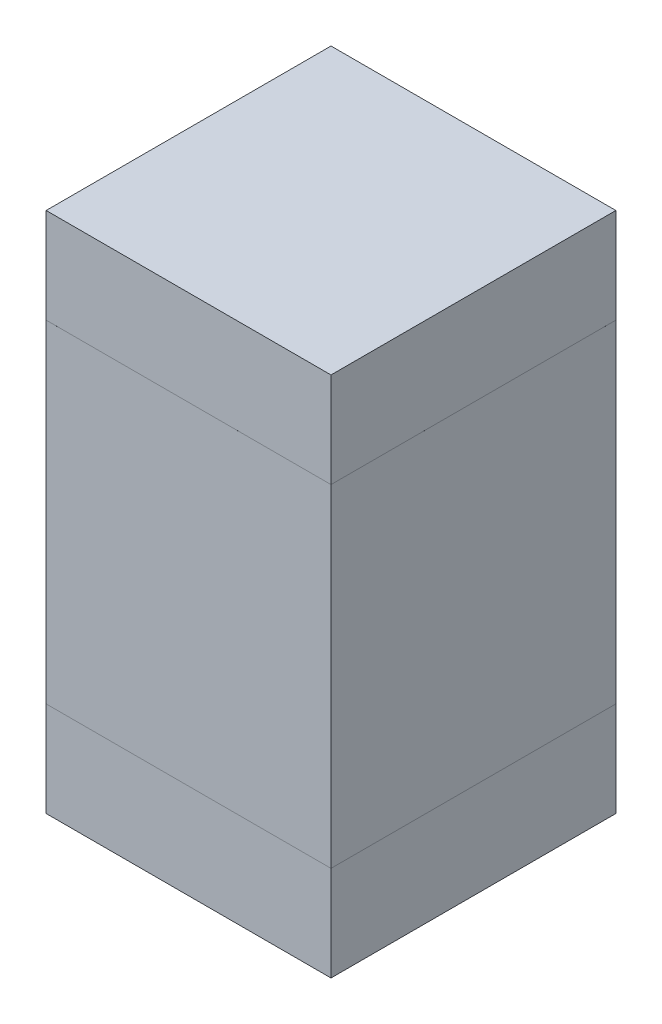
ISO-10303-21;
HEADER;
FILE_DESCRIPTION(('STEP AP214'),'2;1');
FILE_NAME('part.step','',(''),(''),'','','');
FILE_SCHEMA(('AUTOMOTIVE_DESIGN { 1 0 10303 214 1 1 1 1 }'));
ENDSEC;
DATA;
#1=APPLICATION_CONTEXT('core data for automotive mechanical design processes');
#2=APPLICATION_PROTOCOL_DEFINITION('international standard','automotive_design',2000,#1);
#3=PRODUCT_CONTEXT('',#1,'mechanical');
#4=PRODUCT('Part','Part','',(#3));
#5=PRODUCT_RELATED_PRODUCT_CATEGORY('part','',(#4));
#6=PRODUCT_DEFINITION_FORMATION('','',#4);
#7=PRODUCT_DEFINITION_CONTEXT('part definition',#1,'design');
#8=PRODUCT_DEFINITION('design','',#6,#7);
#9=PRODUCT_DEFINITION_SHAPE('','',#8);
#10=(LENGTH_UNIT() NAMED_UNIT(*) SI_UNIT(.MILLI.,.METRE.));
#11=(NAMED_UNIT(*) PLANE_ANGLE_UNIT() SI_UNIT($,.RADIAN.));
#12=(NAMED_UNIT(*) SI_UNIT($,.STERADIAN.) SOLID_ANGLE_UNIT());
#13=UNCERTAINTY_MEASURE_WITH_UNIT(LENGTH_MEASURE(1.E-05),#10,'distance_accuracy_value','');
#14=(GEOMETRIC_REPRESENTATION_CONTEXT(3) GLOBAL_UNCERTAINTY_ASSIGNED_CONTEXT((#13)) GLOBAL_UNIT_ASSIGNED_CONTEXT((#10,
#11,#12)) REPRESENTATION_CONTEXT('',''));
#15=CARTESIAN_POINT('',(0.,0.,0.));
#16=DIRECTION('',(0.,0.,1.));
#17=DIRECTION('',(1.,0.,0.));
#18=AXIS2_PLACEMENT_3D('',#15,#16,#17);
#19=CARTESIAN_POINT('',(1.449994365938,3.849998674316,0.5999988));
#20=DIRECTION('',(0.,0.,-1.));
#21=DIRECTION('',(0.,-1.,0.));
#22=AXIS2_PLACEMENT_3D('',#19,#20,#21);
#23=PLANE('',#22);
#24=DIRECTION('',(-1.,0.,0.));
#25=VECTOR('',#24,1.);
#26=CARTESIAN_POINT('',(1.449994365938,3.849998674316,0.5999988));
#27=LINE('',#26,#25);
#28=CARTESIAN_POINT('',(1.449994365938,3.849998674316,0.5999988));
#29=VERTEX_POINT('',#28);
#30=CARTESIAN_POINT('',(0.849995565938,3.849998674316,0.5999988));
#31=VERTEX_POINT('',#30);
#32=EDGE_CURVE('P0_E92',#29,#31,#27,.T.);
#33=ORIENTED_EDGE('',*,*,#32,.T.);
#34=DIRECTION('',(0.,-1.,0.));
#35=VECTOR('',#34,1.);
#36=CARTESIAN_POINT('',(0.849995565938,3.849998674316,0.5999988));
#37=LINE('',#36,#35);
#38=CARTESIAN_POINT('',(0.849995565938,3.149997534316,0.5999988));
#39=VERTEX_POINT('',#38);
#40=EDGE_CURVE('P0_E71',#31,#39,#37,.T.);
#41=ORIENTED_EDGE('',*,*,#40,.T.);
#42=DIRECTION('',(1.,0.,0.));
#43=VECTOR('',#42,1.);
#44=CARTESIAN_POINT('',(0.849995565938,3.149997534316,0.5999988));
#45=LINE('',#44,#43);
#46=CARTESIAN_POINT('',(1.449994365938,3.149997534316,0.5999988));
#47=VERTEX_POINT('',#46);
#48=EDGE_CURVE('P0_E76',#39,#47,#45,.T.);
#49=ORIENTED_EDGE('',*,*,#48,.T.);
#50=DIRECTION('',(0.,1.,0.));
#51=VECTOR('',#50,1.);
#52=CARTESIAN_POINT('',(1.449994365938,3.149997534316,0.5999988));
#53=LINE('',#52,#51);
#54=EDGE_CURVE('P0_E11',#47,#29,#53,.T.);
#55=ORIENTED_EDGE('',*,*,#54,.T.);
#56=EDGE_LOOP('',(#33,#41,#49,#55));
#57=FACE_BOUND('',#56,.T.);
#58=ADVANCED_FACE('P0_F17',(#57),#23,.F.);
#59=CARTESIAN_POINT('',(1.449994365938,3.849998674316,0.));
#60=DIRECTION('',(0.,0.,-1.));
#61=DIRECTION('',(0.,-1.,0.));
#62=AXIS2_PLACEMENT_3D('',#59,#60,#61);
#63=PLANE('',#62);
#64=DIRECTION('',(0.,1.,0.));
#65=VECTOR('',#64,1.);
#66=CARTESIAN_POINT('',(1.449994365938,3.149997534316,0.));
#67=LINE('',#66,#65);
#68=CARTESIAN_POINT('',(1.449994365938,3.149997534316,0.));
#69=VERTEX_POINT('',#68);
#70=CARTESIAN_POINT('',(1.449994365938,3.849998674316,0.));
#71=VERTEX_POINT('',#70);
#72=EDGE_CURVE('P0_E26',#69,#71,#67,.T.);
#73=ORIENTED_EDGE('',*,*,#72,.F.);
#74=DIRECTION('',(1.,0.,0.));
#75=VECTOR('',#74,1.);
#76=CARTESIAN_POINT('',(0.849995565938,3.149997534316,0.));
#77=LINE('',#76,#75);
#78=CARTESIAN_POINT('',(0.849995565938,3.149997534316,0.));
#79=VERTEX_POINT('',#78);
#80=EDGE_CURVE('P0_E62',#79,#69,#77,.T.);
#81=ORIENTED_EDGE('',*,*,#80,.F.);
#82=DIRECTION('',(0.,-1.,0.));
#83=VECTOR('',#82,1.);
#84=CARTESIAN_POINT('',(0.849995565938,3.849998674316,0.));
#85=LINE('',#84,#83);
#86=CARTESIAN_POINT('',(0.849995565938,3.849998674316,0.));
#87=VERTEX_POINT('',#86);
#88=EDGE_CURVE('P0_E65',#87,#79,#85,.T.);
#89=ORIENTED_EDGE('',*,*,#88,.F.);
#90=DIRECTION('',(-1.,0.,0.));
#91=VECTOR('',#90,1.);
#92=CARTESIAN_POINT('',(1.449994365938,3.849998674316,0.));
#93=LINE('',#92,#91);
#94=EDGE_CURVE('P0_E111',#71,#87,#93,.T.);
#95=ORIENTED_EDGE('',*,*,#94,.F.);
#96=EDGE_LOOP('',(#73,#81,#89,#95));
#97=FACE_BOUND('',#96,.T.);
#98=ADVANCED_FACE('P0_F19',(#97),#63,.T.);
#99=CARTESIAN_POINT('',(1.449994365938,3.149997534316,0.));
#100=DIRECTION('',(-1.,0.,0.));
#101=DIRECTION('',(0.,0.,1.));
#102=AXIS2_PLACEMENT_3D('',#99,#100,#101);
#103=PLANE('',#102);
#104=ORIENTED_EDGE('',*,*,#72,.T.);
#105=DIRECTION('',(0.,0.,1.));
#106=VECTOR('',#105,1.);
#107=CARTESIAN_POINT('',(1.449994365938,3.849998674316,0.));
#108=LINE('',#107,#106);
#109=EDGE_CURVE('P0_E87',#71,#29,#108,.T.);
#110=ORIENTED_EDGE('',*,*,#109,.T.);
#111=ORIENTED_EDGE('',*,*,#54,.F.);
#112=DIRECTION('',(0.,0.,1.));
#113=VECTOR('',#112,1.);
#114=CARTESIAN_POINT('',(1.449994365938,3.149997534316,0.));
#115=LINE('',#114,#113);
#116=EDGE_CURVE('P0_E70',#69,#47,#115,.T.);
#117=ORIENTED_EDGE('',*,*,#116,.F.);
#118=EDGE_LOOP('',(#104,#110,#111,#117));
#119=FACE_BOUND('',#118,.T.);
#120=ADVANCED_FACE('P0_F106',(#119),#103,.F.);
#121=CARTESIAN_POINT('',(0.849995565938,3.149997534316,0.));
#122=DIRECTION('',(0.,1.,0.));
#123=DIRECTION('',(1.,0.,0.));
#124=AXIS2_PLACEMENT_3D('',#121,#122,#123);
#125=PLANE('',#124);
#126=ORIENTED_EDGE('',*,*,#80,.T.);
#127=ORIENTED_EDGE('',*,*,#116,.T.);
#128=ORIENTED_EDGE('',*,*,#48,.F.);
#129=DIRECTION('',(0.,0.,1.));
#130=VECTOR('',#129,1.);
#131=CARTESIAN_POINT('',(0.849995565938,3.149997534316,0.));
#132=LINE('',#131,#130);
#133=EDGE_CURVE('P0_E74',#79,#39,#132,.T.);
#134=ORIENTED_EDGE('',*,*,#133,.F.);
#135=EDGE_LOOP('',(#126,#127,#128,#134));
#136=FACE_BOUND('',#135,.T.);
#137=ADVANCED_FACE('P0_F75',(#136),#125,.F.);
#138=CARTESIAN_POINT('',(0.849995565938,3.849998674316,0.));
#139=DIRECTION('',(1.,0.,0.));
#140=DIRECTION('',(0.,1.,0.));
#141=AXIS2_PLACEMENT_3D('',#138,#139,#140);
#142=PLANE('',#141);
#143=ORIENTED_EDGE('',*,*,#88,.T.);
#144=ORIENTED_EDGE('',*,*,#133,.T.);
#145=ORIENTED_EDGE('',*,*,#40,.F.);
#146=DIRECTION('',(0.,0.,1.));
#147=VECTOR('',#146,1.);
#148=CARTESIAN_POINT('',(0.849995565938,3.849998674316,0.));
#149=LINE('',#148,#147);
#150=EDGE_CURVE('P0_E84',#87,#31,#149,.T.);
#151=ORIENTED_EDGE('',*,*,#150,.F.);
#152=EDGE_LOOP('',(#143,#144,#145,#151));
#153=FACE_BOUND('',#152,.T.);
#154=ADVANCED_FACE('P0_F82',(#153),#142,.F.);
#155=CARTESIAN_POINT('',(1.449994365938,3.849998674316,0.));
#156=DIRECTION('',(0.,-1.,0.));
#157=DIRECTION('',(0.,0.,-1.));
#158=AXIS2_PLACEMENT_3D('',#155,#156,#157);
#159=PLANE('',#158);
#160=ORIENTED_EDGE('',*,*,#94,.T.);
#161=ORIENTED_EDGE('',*,*,#150,.T.);
#162=ORIENTED_EDGE('',*,*,#32,.F.);
#163=ORIENTED_EDGE('',*,*,#109,.F.);
#164=EDGE_LOOP('',(#160,#161,#162,#163));
#165=FACE_BOUND('',#164,.T.);
#166=ADVANCED_FACE('P0_F110',(#165),#159,.F.);
#167=CLOSED_SHELL('',(#58,#98,#120,#137,#154,#166));
#168=MANIFOLD_SOLID_BREP('P0_B1',#167);
#169=CARTESIAN_POINT('',(1.449994365938,3.149999686074,0.5999988));
#170=DIRECTION('',(0.,0.,-1.));
#171=DIRECTION('',(0.,-1.,0.));
#172=AXIS2_PLACEMENT_3D('',#169,#170,#171);
#173=PLANE('',#172);
#174=DIRECTION('',(-1.,0.,0.));
#175=VECTOR('',#174,1.);
#176=CARTESIAN_POINT('',(1.449994365938,3.149999686074,0.5999988));
#177=LINE('',#176,#175);
#178=CARTESIAN_POINT('',(1.449994365938,3.149999686074,0.5999988));
#179=VERTEX_POINT('',#178);
#180=CARTESIAN_POINT('',(0.849995565938,3.149999686074,0.5999988));
#181=VERTEX_POINT('',#180);
#182=EDGE_CURVE('P1_E93',#179,#181,#177,.T.);
#183=ORIENTED_EDGE('',*,*,#182,.T.);
#184=DIRECTION('',(0.,-1.,0.));
#185=VECTOR('',#184,1.);
#186=CARTESIAN_POINT('',(0.849995565938,3.149999686074,0.5999988));
#187=LINE('',#186,#185);
#188=CARTESIAN_POINT('',(0.849995565938,2.950000086074,0.5999988));
#189=VERTEX_POINT('',#188);
#190=EDGE_CURVE('P1_E74',#181,#189,#187,.T.);
#191=ORIENTED_EDGE('',*,*,#190,.T.);
#192=DIRECTION('',(1.,0.,0.));
#193=VECTOR('',#192,1.);
#194=CARTESIAN_POINT('',(0.849995565938,2.950000086074,0.5999988));
#195=LINE('',#194,#193);
#196=CARTESIAN_POINT('',(1.449994365938,2.950000086074,0.5999988));
#197=VERTEX_POINT('',#196);
#198=EDGE_CURVE('P1_E79',#189,#197,#195,.T.);
#199=ORIENTED_EDGE('',*,*,#198,.T.);
#200=DIRECTION('',(0.,1.,0.));
#201=VECTOR('',#200,1.);
#202=CARTESIAN_POINT('',(1.449994365938,2.950000086074,0.5999988));
#203=LINE('',#202,#201);
#204=EDGE_CURVE('P1_E11',#197,#179,#203,.T.);
#205=ORIENTED_EDGE('',*,*,#204,.T.);
#206=EDGE_LOOP('',(#183,#191,#199,#205));
#207=FACE_BOUND('',#206,.T.);
#208=ADVANCED_FACE('P1_F17',(#207),#173,.F.);
#209=CARTESIAN_POINT('',(1.449994365938,3.149999686074,0.));
#210=DIRECTION('',(0.,0.,-1.));
#211=DIRECTION('',(0.,-1.,0.));
#212=AXIS2_PLACEMENT_3D('',#209,#210,#211);
#213=PLANE('',#212);
#214=DIRECTION('',(0.,1.,0.));
#215=VECTOR('',#214,1.);
#216=CARTESIAN_POINT('',(1.449994365938,2.950000086074,0.));
#217=LINE('',#216,#215);
#218=CARTESIAN_POINT('',(1.449994365938,2.950000086074,0.));
#219=VERTEX_POINT('',#218);
#220=CARTESIAN_POINT('',(1.449994365938,3.149999686074,0.));
#221=VERTEX_POINT('',#220);
#222=EDGE_CURVE('P1_E26',#219,#221,#217,.T.);
#223=ORIENTED_EDGE('',*,*,#222,.F.);
#224=DIRECTION('',(1.,0.,0.));
#225=VECTOR('',#224,1.);
#226=CARTESIAN_POINT('',(0.849995565938,2.950000086074,0.));
#227=LINE('',#226,#225);
#228=CARTESIAN_POINT('',(0.849995565938,2.950000086074,0.));
#229=VERTEX_POINT('',#228);
#230=EDGE_CURVE('P1_E65',#229,#219,#227,.T.);
#231=ORIENTED_EDGE('',*,*,#230,.F.);
#232=DIRECTION('',(0.,-1.,0.));
#233=VECTOR('',#232,1.);
#234=CARTESIAN_POINT('',(0.849995565938,3.149999686074,0.));
#235=LINE('',#234,#233);
#236=CARTESIAN_POINT('',(0.849995565938,3.149999686074,0.));
#237=VERTEX_POINT('',#236);
#238=EDGE_CURVE('P1_E68',#237,#229,#235,.T.);
#239=ORIENTED_EDGE('',*,*,#238,.F.);
#240=DIRECTION('',(-1.,0.,0.));
#241=VECTOR('',#240,1.);
#242=CARTESIAN_POINT('',(1.449994365938,3.149999686074,0.));
#243=LINE('',#242,#241);
#244=EDGE_CURVE('P1_E113',#221,#237,#243,.T.);
#245=ORIENTED_EDGE('',*,*,#244,.F.);
#246=EDGE_LOOP('',(#223,#231,#239,#245));
#247=FACE_BOUND('',#246,.T.);
#248=ADVANCED_FACE('P1_F19',(#247),#213,.T.);
#249=CARTESIAN_POINT('',(1.449994365938,2.950000086074,0.));
#250=DIRECTION('',(-1.,0.,0.));
#251=DIRECTION('',(0.,0.,1.));
#252=AXIS2_PLACEMENT_3D('',#249,#250,#251);
#253=PLANE('',#252);
#254=ORIENTED_EDGE('',*,*,#222,.T.);
#255=DIRECTION('',(0.,0.,1.));
#256=VECTOR('',#255,1.);
#257=CARTESIAN_POINT('',(1.449994365938,3.149999686074,0.));
#258=LINE('',#257,#256);
#259=EDGE_CURVE('P1_E89',#221,#179,#258,.T.);
#260=ORIENTED_EDGE('',*,*,#259,.T.);
#261=ORIENTED_EDGE('',*,*,#204,.F.);
#262=DIRECTION('',(0.,0.,1.));
#263=VECTOR('',#262,1.);
#264=CARTESIAN_POINT('',(1.449994365938,2.950000086074,0.));
#265=LINE('',#264,#263);
#266=EDGE_CURVE('P1_E73',#219,#197,#265,.T.);
#267=ORIENTED_EDGE('',*,*,#266,.F.);
#268=EDGE_LOOP('',(#254,#260,#261,#267));
#269=FACE_BOUND('',#268,.T.);
#270=ADVANCED_FACE('P1_F106',(#269),#253,.F.);
#271=CARTESIAN_POINT('',(0.849995565938,2.950000086074,0.));
#272=DIRECTION('',(0.,1.,0.));
#273=DIRECTION('',(1.,0.,0.));
#274=AXIS2_PLACEMENT_3D('',#271,#272,#273);
#275=PLANE('',#274);
#276=ORIENTED_EDGE('',*,*,#230,.T.);
#277=ORIENTED_EDGE('',*,*,#266,.T.);
#278=ORIENTED_EDGE('',*,*,#198,.F.);
#279=DIRECTION('',(0.,0.,1.));
#280=VECTOR('',#279,1.);
#281=CARTESIAN_POINT('',(0.849995565938,2.950000086074,0.));
#282=LINE('',#281,#280);
#283=EDGE_CURVE('P1_E77',#229,#189,#282,.T.);
#284=ORIENTED_EDGE('',*,*,#283,.F.);
#285=EDGE_LOOP('',(#276,#277,#278,#284));
#286=FACE_BOUND('',#285,.T.);
#287=ADVANCED_FACE('P1_F78',(#286),#275,.F.);
#288=CARTESIAN_POINT('',(0.849995565938,3.149999686074,0.));
#289=DIRECTION('',(1.,0.,0.));
#290=DIRECTION('',(0.,1.,0.));
#291=AXIS2_PLACEMENT_3D('',#288,#289,#290);
#292=PLANE('',#291);
#293=ORIENTED_EDGE('',*,*,#238,.T.);
#294=ORIENTED_EDGE('',*,*,#283,.T.);
#295=ORIENTED_EDGE('',*,*,#190,.F.);
#296=DIRECTION('',(0.,0.,1.));
#297=VECTOR('',#296,1.);
#298=CARTESIAN_POINT('',(0.849995565938,3.149999686074,0.));
#299=LINE('',#298,#297);
#300=EDGE_CURVE('P1_E86',#237,#181,#299,.T.);
#301=ORIENTED_EDGE('',*,*,#300,.F.);
#302=EDGE_LOOP('',(#293,#294,#295,#301));
#303=FACE_BOUND('',#302,.T.);
#304=ADVANCED_FACE('P1_F84',(#303),#292,.F.);
#305=CARTESIAN_POINT('',(1.449994365938,3.149999686074,0.));
#306=DIRECTION('',(0.,-1.,0.));
#307=DIRECTION('',(0.,0.,-1.));
#308=AXIS2_PLACEMENT_3D('',#305,#306,#307);
#309=PLANE('',#308);
#310=ORIENTED_EDGE('',*,*,#244,.T.);
#311=ORIENTED_EDGE('',*,*,#300,.T.);
#312=ORIENTED_EDGE('',*,*,#182,.F.);
#313=ORIENTED_EDGE('',*,*,#259,.F.);
#314=EDGE_LOOP('',(#310,#311,#312,#313));
#315=FACE_BOUND('',#314,.T.);
#316=ADVANCED_FACE('P1_F112',(#315),#309,.F.);
#317=CLOSED_SHELL('',(#208,#248,#270,#287,#304,#316));
#318=MANIFOLD_SOLID_BREP('P1_B1',#317);
#319=CARTESIAN_POINT('',(1.449994365938,4.050001211953,0.5999988));
#320=DIRECTION('',(0.,0.,-1.));
#321=DIRECTION('',(0.,-1.,0.));
#322=AXIS2_PLACEMENT_3D('',#319,#320,#321);
#323=PLANE('',#322);
#324=DIRECTION('',(-1.,0.,0.));
#325=VECTOR('',#324,1.);
#326=CARTESIAN_POINT('',(1.449994365938,4.050001211953,0.5999988));
#327=LINE('',#326,#325);
#328=CARTESIAN_POINT('',(1.449994365938,4.050001211953,0.5999988));
#329=VERTEX_POINT('',#328);
#330=CARTESIAN_POINT('',(0.849995565938,4.050001211953,0.5999988));
#331=VERTEX_POINT('',#330);
#332=EDGE_CURVE('P2_E81',#329,#331,#327,.T.);
#333=ORIENTED_EDGE('',*,*,#332,.T.);
#334=DIRECTION('',(0.,-1.,0.));
#335=VECTOR('',#334,1.);
#336=CARTESIAN_POINT('',(0.849995565938,4.050001211953,0.5999988));
#337=LINE('',#336,#335);
#338=CARTESIAN_POINT('',(0.849995565938,3.850001611953,0.5999988));
#339=VERTEX_POINT('',#338);
#340=EDGE_CURVE('P2_E108',#331,#339,#337,.T.);
#341=ORIENTED_EDGE('',*,*,#340,.T.);
#342=DIRECTION('',(1.,0.,0.));
#343=VECTOR('',#342,1.);
#344=CARTESIAN_POINT('',(0.849995565938,3.850001611953,0.5999988));
#345=LINE('',#344,#343);
#346=CARTESIAN_POINT('',(1.449994365938,3.850001611953,0.5999988));
#347=VERTEX_POINT('',#346);
#348=EDGE_CURVE('P2_E74',#339,#347,#345,.T.);
#349=ORIENTED_EDGE('',*,*,#348,.T.);
#350=DIRECTION('',(0.,1.,0.));
#351=VECTOR('',#350,1.);
#352=CARTESIAN_POINT('',(1.449994365938,3.850001611953,0.5999988));
#353=LINE('',#352,#351);
#354=EDGE_CURVE('P2_E11',#347,#329,#353,.T.);
#355=ORIENTED_EDGE('',*,*,#354,.T.);
#356=EDGE_LOOP('',(#333,#341,#349,#355));
#357=FACE_BOUND('',#356,.T.);
#358=ADVANCED_FACE('P2_F17',(#357),#323,.F.);
#359=CARTESIAN_POINT('',(1.449994365938,4.050001211953,0.));
#360=DIRECTION('',(0.,0.,-1.));
#361=DIRECTION('',(0.,-1.,0.));
#362=AXIS2_PLACEMENT_3D('',#359,#360,#361);
#363=PLANE('',#362);
#364=DIRECTION('',(0.,1.,0.));
#365=VECTOR('',#364,1.);
#366=CARTESIAN_POINT('',(1.449994365938,3.850001611953,0.));
#367=LINE('',#366,#365);
#368=CARTESIAN_POINT('',(1.449994365938,3.850001611953,0.));
#369=VERTEX_POINT('',#368);
#370=CARTESIAN_POINT('',(1.449994365938,4.050001211953,0.));
#371=VERTEX_POINT('',#370);
#372=EDGE_CURVE('P2_E25',#369,#371,#367,.T.);
#373=ORIENTED_EDGE('',*,*,#372,.F.);
#374=DIRECTION('',(1.,0.,0.));
#375=VECTOR('',#374,1.);
#376=CARTESIAN_POINT('',(0.849995565938,3.850001611953,0.));
#377=LINE('',#376,#375);
#378=CARTESIAN_POINT('',(0.849995565938,3.850001611953,0.));
#379=VERTEX_POINT('',#378);
#380=EDGE_CURVE('P2_E104',#379,#369,#377,.T.);
#381=ORIENTED_EDGE('',*,*,#380,.F.);
#382=DIRECTION('',(0.,-1.,0.));
#383=VECTOR('',#382,1.);
#384=CARTESIAN_POINT('',(0.849995565938,4.050001211953,0.));
#385=LINE('',#384,#383);
#386=CARTESIAN_POINT('',(0.849995565938,4.050001211953,0.));
#387=VERTEX_POINT('',#386);
#388=EDGE_CURVE('P2_E83',#387,#379,#385,.T.);
#389=ORIENTED_EDGE('',*,*,#388,.F.);
#390=DIRECTION('',(-1.,0.,0.));
#391=VECTOR('',#390,1.);
#392=CARTESIAN_POINT('',(1.449994365938,4.050001211953,0.));
#393=LINE('',#392,#391);
#394=EDGE_CURVE('P2_E79',#371,#387,#393,.T.);
#395=ORIENTED_EDGE('',*,*,#394,.F.);
#396=EDGE_LOOP('',(#373,#381,#389,#395));
#397=FACE_BOUND('',#396,.T.);
#398=ADVANCED_FACE('P2_F85',(#397),#363,.T.);
#399=CARTESIAN_POINT('',(1.449994365938,3.850001611953,0.));
#400=DIRECTION('',(-1.,0.,0.));
#401=DIRECTION('',(0.,0.,1.));
#402=AXIS2_PLACEMENT_3D('',#399,#400,#401);
#403=PLANE('',#402);
#404=ORIENTED_EDGE('',*,*,#372,.T.);
#405=DIRECTION('',(0.,0.,1.));
#406=VECTOR('',#405,1.);
#407=CARTESIAN_POINT('',(1.449994365938,4.050001211953,0.));
#408=LINE('',#407,#406);
#409=EDGE_CURVE('P2_E68',#371,#329,#408,.T.);
#410=ORIENTED_EDGE('',*,*,#409,.T.);
#411=ORIENTED_EDGE('',*,*,#354,.F.);
#412=DIRECTION('',(0.,0.,1.));
#413=VECTOR('',#412,1.);
#414=CARTESIAN_POINT('',(1.449994365938,3.850001611953,0.));
#415=LINE('',#414,#413);
#416=EDGE_CURVE('P2_E71',#369,#347,#415,.T.);
#417=ORIENTED_EDGE('',*,*,#416,.F.);
#418=EDGE_LOOP('',(#404,#410,#411,#417));
#419=FACE_BOUND('',#418,.T.);
#420=ADVANCED_FACE('P2_F67',(#419),#403,.F.);
#421=CARTESIAN_POINT('',(0.849995565938,3.850001611953,0.));
#422=DIRECTION('',(0.,1.,0.));
#423=DIRECTION('',(1.,0.,0.));
#424=AXIS2_PLACEMENT_3D('',#421,#422,#423);
#425=PLANE('',#424);
#426=ORIENTED_EDGE('',*,*,#380,.T.);
#427=ORIENTED_EDGE('',*,*,#416,.T.);
#428=ORIENTED_EDGE('',*,*,#348,.F.);
#429=DIRECTION('',(0.,0.,1.));
#430=VECTOR('',#429,1.);
#431=CARTESIAN_POINT('',(0.849995565938,3.850001611953,0.));
#432=LINE('',#431,#430);
#433=EDGE_CURVE('P2_E101',#379,#339,#432,.T.);
#434=ORIENTED_EDGE('',*,*,#433,.F.);
#435=EDGE_LOOP('',(#426,#427,#428,#434));
#436=FACE_BOUND('',#435,.T.);
#437=ADVANCED_FACE('P2_F116',(#436),#425,.F.);
#438=CARTESIAN_POINT('',(0.849995565938,4.050001211953,0.));
#439=DIRECTION('',(1.,0.,0.));
#440=DIRECTION('',(0.,1.,0.));
#441=AXIS2_PLACEMENT_3D('',#438,#439,#440);
#442=PLANE('',#441);
#443=ORIENTED_EDGE('',*,*,#388,.T.);
#444=ORIENTED_EDGE('',*,*,#433,.T.);
#445=ORIENTED_EDGE('',*,*,#340,.F.);
#446=DIRECTION('',(0.,0.,1.));
#447=VECTOR('',#446,1.);
#448=CARTESIAN_POINT('',(0.849995565938,4.050001211953,0.));
#449=LINE('',#448,#447);
#450=EDGE_CURVE('P2_E89',#387,#331,#449,.T.);
#451=ORIENTED_EDGE('',*,*,#450,.F.);
#452=EDGE_LOOP('',(#443,#444,#445,#451));
#453=FACE_BOUND('',#452,.T.);
#454=ADVANCED_FACE('P2_F118',(#453),#442,.F.);
#455=CARTESIAN_POINT('',(1.449994365938,4.050001211953,0.));
#456=DIRECTION('',(0.,-1.,0.));
#457=DIRECTION('',(0.,0.,-1.));
#458=AXIS2_PLACEMENT_3D('',#455,#456,#457);
#459=PLANE('',#458);
#460=ORIENTED_EDGE('',*,*,#394,.T.);
#461=ORIENTED_EDGE('',*,*,#450,.T.);
#462=ORIENTED_EDGE('',*,*,#332,.F.);
#463=ORIENTED_EDGE('',*,*,#409,.F.);
#464=EDGE_LOOP('',(#460,#461,#462,#463));
#465=FACE_BOUND('',#464,.T.);
#466=ADVANCED_FACE('P2_F77',(#465),#459,.F.);
#467=CLOSED_SHELL('',(#358,#398,#420,#437,#454,#466));
#468=MANIFOLD_SOLID_BREP('P2_B1',#467);
#469=ADVANCED_BREP_SHAPE_REPRESENTATION('',(#18,#168,#318,#468),#14);
#470=SHAPE_DEFINITION_REPRESENTATION(#9,#469);
ENDSEC;
END-ISO-10303-21;
